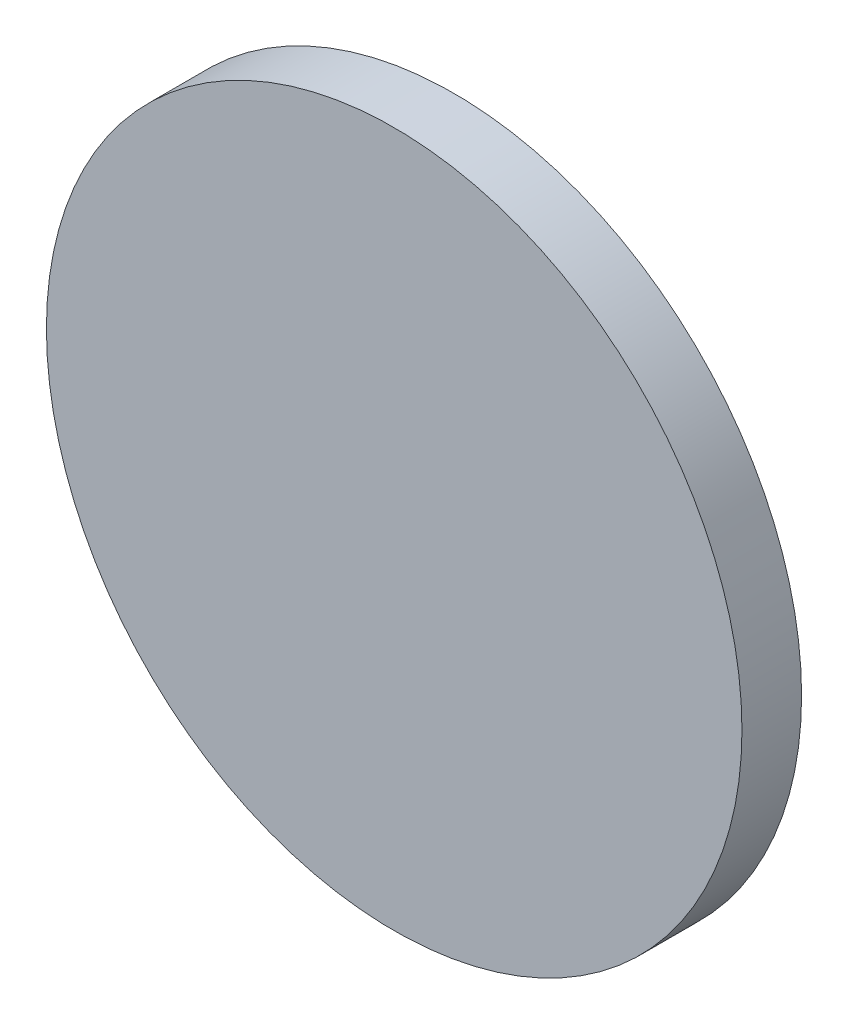
ISO-10303-21;
HEADER;
FILE_DESCRIPTION(('STEP AP214'),'2;1');
FILE_NAME('part.step','',(''),(''),'','','');
FILE_SCHEMA(('AUTOMOTIVE_DESIGN { 1 0 10303 214 1 1 1 1 }'));
ENDSEC;
DATA;
#1=APPLICATION_CONTEXT('core data for automotive mechanical design processes');
#2=APPLICATION_PROTOCOL_DEFINITION('international standard','automotive_design',2000,#1);
#3=PRODUCT_CONTEXT('',#1,'mechanical');
#4=PRODUCT('Part','Part','',(#3));
#5=PRODUCT_RELATED_PRODUCT_CATEGORY('part','',(#4));
#6=PRODUCT_DEFINITION_FORMATION('','',#4);
#7=PRODUCT_DEFINITION_CONTEXT('part definition',#1,'design');
#8=PRODUCT_DEFINITION('design','',#6,#7);
#9=PRODUCT_DEFINITION_SHAPE('','',#8);
#10=(LENGTH_UNIT() NAMED_UNIT(*) SI_UNIT(.MILLI.,.METRE.));
#11=(NAMED_UNIT(*) PLANE_ANGLE_UNIT() SI_UNIT($,.RADIAN.));
#12=(NAMED_UNIT(*) SI_UNIT($,.STERADIAN.) SOLID_ANGLE_UNIT());
#13=UNCERTAINTY_MEASURE_WITH_UNIT(LENGTH_MEASURE(1.E-05),#10,'distance_accuracy_value','');
#14=(GEOMETRIC_REPRESENTATION_CONTEXT(3) GLOBAL_UNCERTAINTY_ASSIGNED_CONTEXT((#13)) GLOBAL_UNIT_ASSIGNED_CONTEXT((#10,
#11,#12)) REPRESENTATION_CONTEXT('',''));
#15=CARTESIAN_POINT('',(0.,0.,0.));
#16=DIRECTION('',(0.,0.,1.));
#17=DIRECTION('',(1.,0.,0.));
#18=AXIS2_PLACEMENT_3D('',#15,#16,#17);
#19=CARTESIAN_POINT('',(10.07618,1.986280014875,0.));
#20=DIRECTION('',(0.,0.,-1.));
#21=DIRECTION('',(-1.,0.,0.));
#22=AXIS2_PLACEMENT_3D('',#19,#20,#21);
#23=PLANE('',#22);
#24=CARTESIAN_POINT('',(10.07618,1.986280014875,0.));
#25=DIRECTION('',(0.,0.,1.));
#26=DIRECTION('',(1.,0.,0.));
#27=AXIS2_PLACEMENT_3D('',#24,#25,#26);
#28=CIRCLE('',#27,0.200024667);
#29=CARTESIAN_POINT('',(10.276204667,1.986280014875,0.));
#30=VERTEX_POINT('',#29);
#31=EDGE_CURVE('E18',#30,#30,#28,.T.);
#32=ORIENTED_EDGE('',*,*,#31,.F.);
#33=EDGE_LOOP('',(#32));
#34=FACE_BOUND('',#33,.T.);
#35=ADVANCED_FACE('F15',(#34),#23,.T.);
#36=CARTESIAN_POINT('',(10.07618,1.986280014875,0.));
#37=DIRECTION('',(0.,0.,1.));
#38=DIRECTION('',(1.,0.,0.));
#39=AXIS2_PLACEMENT_3D('',#36,#37,#38);
#40=CYLINDRICAL_SURFACE('',#39,0.200024667);
#41=CARTESIAN_POINT('',(10.07618,1.986280014875,0.03429));
#42=DIRECTION('',(0.,0.,1.));
#43=DIRECTION('',(1.,0.,0.));
#44=AXIS2_PLACEMENT_3D('',#41,#42,#43);
#45=CIRCLE('',#44,0.200024667);
#46=CARTESIAN_POINT('',(10.276204667,1.986280014875,0.03429));
#47=VERTEX_POINT('',#46);
#48=EDGE_CURVE('E10',#47,#47,#45,.T.);
#49=ORIENTED_EDGE('',*,*,#48,.F.);
#50=EDGE_LOOP('',(#49));
#51=FACE_BOUND('',#50,.T.);
#52=ORIENTED_EDGE('',*,*,#31,.T.);
#53=EDGE_LOOP('',(#52));
#54=FACE_BOUND('',#53,.T.);
#55=ADVANCED_FACE('F27',(#51,#54),#40,.T.);
#56=CARTESIAN_POINT('',(10.07618,1.986280014875,0.03429));
#57=DIRECTION('',(0.,0.,1.));
#58=DIRECTION('',(1.,0.,0.));
#59=AXIS2_PLACEMENT_3D('',#56,#57,#58);
#60=PLANE('',#59);
#61=ORIENTED_EDGE('',*,*,#48,.T.);
#62=EDGE_LOOP('',(#61));
#63=FACE_BOUND('',#62,.T.);
#64=ADVANCED_FACE('F34',(#63),#60,.T.);
#65=CLOSED_SHELL('',(#35,#55,#64));
#66=MANIFOLD_SOLID_BREP('B1',#65);
#67=ADVANCED_BREP_SHAPE_REPRESENTATION('',(#18,#66),#14);
#68=SHAPE_DEFINITION_REPRESENTATION(#9,#67);
ENDSEC;
END-ISO-10303-21;
